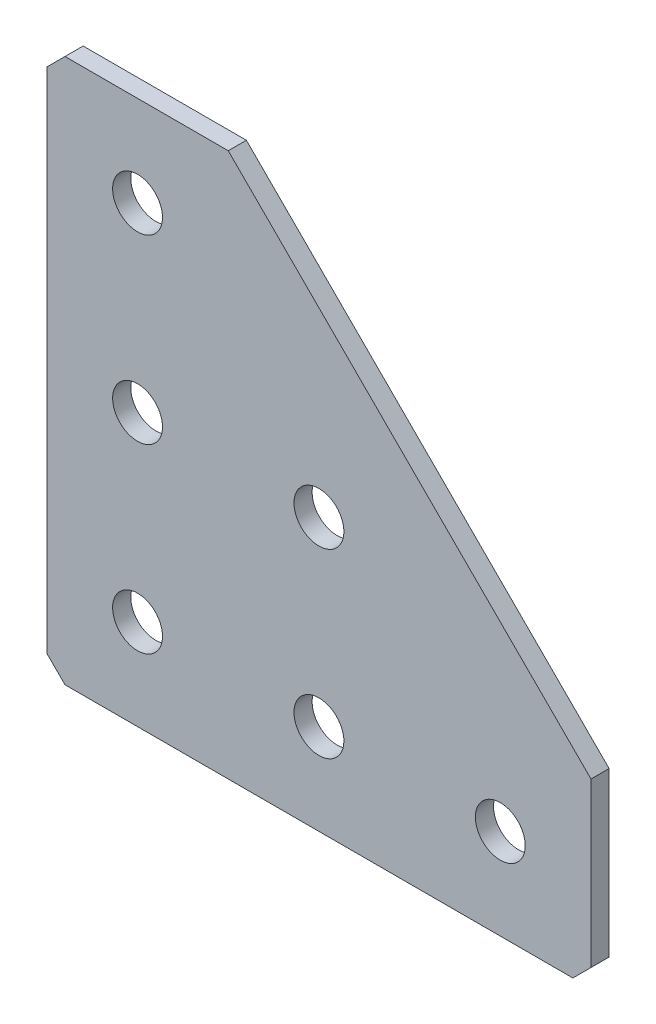
ISO-10303-21;
HEADER;
FILE_DESCRIPTION(('STEP AP214'),'2;1');
FILE_NAME('part.step','',(''),(''),'','','');
FILE_SCHEMA(('AUTOMOTIVE_DESIGN { 1 0 10303 214 1 1 1 1 }'));
ENDSEC;
DATA;
#1=APPLICATION_CONTEXT('core data for automotive mechanical design processes');
#2=APPLICATION_PROTOCOL_DEFINITION('international standard','automotive_design',2000,#1);
#3=PRODUCT_CONTEXT('',#1,'mechanical');
#4=PRODUCT('Part','Part','',(#3));
#5=PRODUCT_RELATED_PRODUCT_CATEGORY('part','',(#4));
#6=PRODUCT_DEFINITION_FORMATION('','',#4);
#7=PRODUCT_DEFINITION_CONTEXT('part definition',#1,'design');
#8=PRODUCT_DEFINITION('design','',#6,#7);
#9=PRODUCT_DEFINITION_SHAPE('','',#8);
#10=(LENGTH_UNIT() NAMED_UNIT(*) SI_UNIT(.MILLI.,.METRE.));
#11=(NAMED_UNIT(*) PLANE_ANGLE_UNIT() SI_UNIT($,.RADIAN.));
#12=(NAMED_UNIT(*) SI_UNIT($,.STERADIAN.) SOLID_ANGLE_UNIT());
#13=UNCERTAINTY_MEASURE_WITH_UNIT(LENGTH_MEASURE(1.E-05),#10,'distance_accuracy_value','');
#14=(GEOMETRIC_REPRESENTATION_CONTEXT(3) GLOBAL_UNCERTAINTY_ASSIGNED_CONTEXT((#13)) GLOBAL_UNIT_ASSIGNED_CONTEXT((#10,
#11,#12)) REPRESENTATION_CONTEXT('',''));
#15=CARTESIAN_POINT('',(0.,0.,0.));
#16=DIRECTION('',(0.,0.,1.));
#17=DIRECTION('',(1.,0.,0.));
#18=AXIS2_PLACEMENT_3D('',#15,#16,#17);
#19=CARTESIAN_POINT('',(0.,0.,0.));
#20=DIRECTION('',(0.,0.,1.));
#21=DIRECTION('',(1.,0.,0.));
#22=AXIS2_PLACEMENT_3D('',#19,#20,#21);
#23=PLANE('',#22);
#24=CARTESIAN_POINT('',(30.,-50.,0.));
#25=DIRECTION('',(0.,0.,-1.));
#26=DIRECTION('',(0.,1.,0.));
#27=AXIS2_PLACEMENT_3D('',#24,#25,#26);
#28=CIRCLE('',#27,2.75);
#29=CARTESIAN_POINT('',(30.,-47.25,0.));
#30=VERTEX_POINT('',#29);
#31=EDGE_CURVE('E251',#30,#30,#28,.T.);
#32=ORIENTED_EDGE('',*,*,#31,.T.);
#33=EDGE_LOOP('',(#32));
#34=FACE_BOUND('',#33,.T.);
#35=CARTESIAN_POINT('',(10.,-50.,0.));
#36=DIRECTION('',(0.,0.,-1.));
#37=DIRECTION('',(0.,1.,0.));
#38=AXIS2_PLACEMENT_3D('',#35,#36,#37);
#39=CIRCLE('',#38,2.75);
#40=CARTESIAN_POINT('',(10.,-47.25,0.));
#41=VERTEX_POINT('',#40);
#42=EDGE_CURVE('E243',#41,#41,#39,.T.);
#43=ORIENTED_EDGE('',*,*,#42,.T.);
#44=EDGE_LOOP('',(#43));
#45=FACE_BOUND('',#44,.T.);
#46=CARTESIAN_POINT('',(10.,-30.,0.));
#47=DIRECTION('',(0.,0.,-1.));
#48=DIRECTION('',(0.,1.,0.));
#49=AXIS2_PLACEMENT_3D('',#46,#47,#48);
#50=CIRCLE('',#49,2.75);
#51=CARTESIAN_POINT('',(10.,-27.25,0.));
#52=VERTEX_POINT('',#51);
#53=EDGE_CURVE('E235',#52,#52,#50,.T.);
#54=ORIENTED_EDGE('',*,*,#53,.T.);
#55=EDGE_LOOP('',(#54));
#56=FACE_BOUND('',#55,.T.);
#57=CARTESIAN_POINT('',(10.,-9.99999999999999,0.));
#58=DIRECTION('',(0.,0.,-1.));
#59=DIRECTION('',(0.,1.,0.));
#60=AXIS2_PLACEMENT_3D('',#57,#58,#59);
#61=CIRCLE('',#60,2.75);
#62=CARTESIAN_POINT('',(10.,-7.25,0.));
#63=VERTEX_POINT('',#62);
#64=EDGE_CURVE('E227',#63,#63,#61,.T.);
#65=ORIENTED_EDGE('',*,*,#64,.T.);
#66=EDGE_LOOP('',(#65));
#67=FACE_BOUND('',#66,.T.);
#68=DIRECTION('',(1.,0.,0.));
#69=VECTOR('',#68,1.);
#70=CARTESIAN_POINT('',(20.,0.,0.));
#71=LINE('',#70,#69);
#72=CARTESIAN_POINT('',(2.00000000000001,0.,0.));
#73=VERTEX_POINT('',#72);
#74=CARTESIAN_POINT('',(20.,0.,0.));
#75=VERTEX_POINT('',#74);
#76=EDGE_CURVE('E137',#73,#75,#71,.T.);
#77=ORIENTED_EDGE('',*,*,#76,.F.);
#78=DIRECTION('',(0.707106781186546,0.707106781186549,0.));
#79=VECTOR('',#78,1.);
#80=CARTESIAN_POINT('',(1.00000000000001,-1.,0.));
#81=LINE('',#80,#79);
#82=CARTESIAN_POINT('',(0.,-2.00000000000002,0.));
#83=VERTEX_POINT('',#82);
#84=EDGE_CURVE('E157',#73,#83,#81,.F.);
#85=ORIENTED_EDGE('',*,*,#84,.T.);
#86=DIRECTION('',(0.,1.,0.));
#87=VECTOR('',#86,1.);
#88=CARTESIAN_POINT('',(0.,0.,0.));
#89=LINE('',#88,#87);
#90=CARTESIAN_POINT('',(0.,-58.,0.));
#91=VERTEX_POINT('',#90);
#92=EDGE_CURVE('E123',#91,#83,#89,.T.);
#93=ORIENTED_EDGE('',*,*,#92,.F.);
#94=DIRECTION('',(-0.707106781186549,0.707106781186546,0.));
#95=VECTOR('',#94,1.);
#96=CARTESIAN_POINT('',(-29.,-29.0000000000001,0.));
#97=LINE('',#96,#95);
#98=CARTESIAN_POINT('',(2.00000000000001,-60.,0.));
#99=VERTEX_POINT('',#98);
#100=EDGE_CURVE('E146',#91,#99,#97,.F.);
#101=ORIENTED_EDGE('',*,*,#100,.T.);
#102=DIRECTION('',(-1.,0.,0.));
#103=VECTOR('',#102,1.);
#104=CARTESIAN_POINT('',(0.,-60.,0.));
#105=LINE('',#104,#103);
#106=CARTESIAN_POINT('',(58.,-60.,0.));
#107=VERTEX_POINT('',#106);
#108=EDGE_CURVE('E182',#107,#99,#105,.T.);
#109=ORIENTED_EDGE('',*,*,#108,.F.);
#110=DIRECTION('',(-0.707106781186546,-0.707106781186549,0.));
#111=VECTOR('',#110,1.);
#112=CARTESIAN_POINT('',(59.0000000000001,-58.9999999999999,0.));
#113=LINE('',#112,#111);
#114=CARTESIAN_POINT('',(60.,-58.,0.));
#115=VERTEX_POINT('',#114);
#116=EDGE_CURVE('E154',#107,#115,#113,.F.);
#117=ORIENTED_EDGE('',*,*,#116,.T.);
#118=DIRECTION('',(0.,-1.,0.));
#119=VECTOR('',#118,1.);
#120=CARTESIAN_POINT('',(60.,-60.,0.));
#121=LINE('',#120,#119);
#122=CARTESIAN_POINT('',(60.,-40.,0.));
#123=VERTEX_POINT('',#122);
#124=EDGE_CURVE('E191',#123,#115,#121,.T.);
#125=ORIENTED_EDGE('',*,*,#124,.F.);
#126=DIRECTION('',(0.707106781186548,-0.707106781186548,0.));
#127=VECTOR('',#126,1.);
#128=CARTESIAN_POINT('',(20.,0.,0.));
#129=LINE('',#128,#127);
#130=EDGE_CURVE('E198',#75,#123,#129,.T.);
#131=ORIENTED_EDGE('',*,*,#130,.F.);
#132=EDGE_LOOP('',(#77,#85,#93,#101,#109,#117,#125,#131));
#133=FACE_BOUND('',#132,.T.);
#134=CARTESIAN_POINT('',(30.,-30.,0.));
#135=DIRECTION('',(0.,0.,-1.));
#136=DIRECTION('',(0.,1.,0.));
#137=AXIS2_PLACEMENT_3D('',#134,#135,#136);
#138=CIRCLE('',#137,2.75);
#139=CARTESIAN_POINT('',(30.,-27.25,0.));
#140=VERTEX_POINT('',#139);
#141=EDGE_CURVE('E205',#140,#140,#138,.T.);
#142=ORIENTED_EDGE('',*,*,#141,.T.);
#143=EDGE_LOOP('',(#142));
#144=FACE_BOUND('',#143,.T.);
#145=CARTESIAN_POINT('',(50.,-50.,0.));
#146=DIRECTION('',(0.,0.,-1.));
#147=DIRECTION('',(0.,1.,0.));
#148=AXIS2_PLACEMENT_3D('',#145,#146,#147);
#149=CIRCLE('',#148,2.75);
#150=CARTESIAN_POINT('',(50.,-47.25,0.));
#151=VERTEX_POINT('',#150);
#152=EDGE_CURVE('E219',#151,#151,#149,.T.);
#153=ORIENTED_EDGE('',*,*,#152,.T.);
#154=EDGE_LOOP('',(#153));
#155=FACE_BOUND('',#154,.T.);
#156=ADVANCED_FACE('F45',(#34,#45,#56,#67,#133,#144,#155),#23,.T.);
#157=CARTESIAN_POINT('',(20.,0.,-2.));
#158=DIRECTION('',(0.,-1.,0.));
#159=DIRECTION('',(1.,0.,0.));
#160=AXIS2_PLACEMENT_3D('',#157,#158,#159);
#161=PLANE('',#160);
#162=DIRECTION('',(1.,0.,0.));
#163=VECTOR('',#162,1.);
#164=CARTESIAN_POINT('',(20.,0.,-2.));
#165=LINE('',#164,#163);
#166=CARTESIAN_POINT('',(2.00000000000001,0.,-2.));
#167=VERTEX_POINT('',#166);
#168=CARTESIAN_POINT('',(20.,0.,-2.));
#169=VERTEX_POINT('',#168);
#170=EDGE_CURVE('E110',#167,#169,#165,.T.);
#171=ORIENTED_EDGE('',*,*,#170,.F.);
#172=DIRECTION('',(0.,0.,1.));
#173=VECTOR('',#172,1.);
#174=CARTESIAN_POINT('',(2.00000000000001,0.,-2.));
#175=LINE('',#174,#173);
#176=EDGE_CURVE('E140',#167,#73,#175,.T.);
#177=ORIENTED_EDGE('',*,*,#176,.T.);
#178=ORIENTED_EDGE('',*,*,#76,.T.);
#179=DIRECTION('',(0.,0.,1.));
#180=VECTOR('',#179,1.);
#181=CARTESIAN_POINT('',(20.,0.,-2.));
#182=LINE('',#181,#180);
#183=EDGE_CURVE('E128',#169,#75,#182,.T.);
#184=ORIENTED_EDGE('',*,*,#183,.F.);
#185=EDGE_LOOP('',(#171,#177,#178,#184));
#186=FACE_BOUND('',#185,.T.);
#187=ADVANCED_FACE('F135',(#186),#161,.F.);
#188=CARTESIAN_POINT('',(20.,0.,-2.));
#189=DIRECTION('',(-0.707106781186547,-0.707106781186547,0.));
#190=DIRECTION('',(0.707106781186548,-0.707106781186548,0.));
#191=AXIS2_PLACEMENT_3D('',#188,#189,#190);
#192=PLANE('',#191);
#193=ORIENTED_EDGE('',*,*,#130,.T.);
#194=DIRECTION('',(0.,0.,1.));
#195=VECTOR('',#194,1.);
#196=CARTESIAN_POINT('',(60.,-40.,-2.));
#197=LINE('',#196,#195);
#198=CARTESIAN_POINT('',(60.,-40.,-2.));
#199=VERTEX_POINT('',#198);
#200=EDGE_CURVE('E130',#199,#123,#197,.T.);
#201=ORIENTED_EDGE('',*,*,#200,.F.);
#202=DIRECTION('',(0.707106781186548,-0.707106781186548,0.));
#203=VECTOR('',#202,1.);
#204=CARTESIAN_POINT('',(20.,0.,-2.));
#205=LINE('',#204,#203);
#206=EDGE_CURVE('E114',#169,#199,#205,.T.);
#207=ORIENTED_EDGE('',*,*,#206,.F.);
#208=ORIENTED_EDGE('',*,*,#183,.T.);
#209=EDGE_LOOP('',(#193,#201,#207,#208));
#210=FACE_BOUND('',#209,.T.);
#211=ADVANCED_FACE('F127',(#210),#192,.F.);
#212=CARTESIAN_POINT('',(60.,-60.,-2.));
#213=DIRECTION('',(-1.,0.,0.));
#214=DIRECTION('',(0.,-1.,0.));
#215=AXIS2_PLACEMENT_3D('',#212,#213,#214);
#216=PLANE('',#215);
#217=ORIENTED_EDGE('',*,*,#124,.T.);
#218=DIRECTION('',(0.,0.,-1.));
#219=VECTOR('',#218,1.);
#220=CARTESIAN_POINT('',(60.,-58.,-2.));
#221=LINE('',#220,#219);
#222=CARTESIAN_POINT('',(60.,-58.,-2.));
#223=VERTEX_POINT('',#222);
#224=EDGE_CURVE('E11',#115,#223,#221,.T.);
#225=ORIENTED_EDGE('',*,*,#224,.T.);
#226=DIRECTION('',(0.,-1.,0.));
#227=VECTOR('',#226,1.);
#228=CARTESIAN_POINT('',(60.,-60.,-2.));
#229=LINE('',#228,#227);
#230=EDGE_CURVE('E133',#199,#223,#229,.T.);
#231=ORIENTED_EDGE('',*,*,#230,.F.);
#232=ORIENTED_EDGE('',*,*,#200,.T.);
#233=EDGE_LOOP('',(#217,#225,#231,#232));
#234=FACE_BOUND('',#233,.T.);
#235=ADVANCED_FACE('F304',(#234),#216,.F.);
#236=CARTESIAN_POINT('',(0.,-60.,-2.));
#237=DIRECTION('',(0.,1.,0.));
#238=DIRECTION('',(0.,0.,1.));
#239=AXIS2_PLACEMENT_3D('',#236,#237,#238);
#240=PLANE('',#239);
#241=DIRECTION('',(-1.,0.,0.));
#242=VECTOR('',#241,1.);
#243=CARTESIAN_POINT('',(0.,-60.,-2.));
#244=LINE('',#243,#242);
#245=CARTESIAN_POINT('',(58.,-60.,-2.));
#246=VERTEX_POINT('',#245);
#247=CARTESIAN_POINT('',(2.00000000000001,-60.,-2.));
#248=VERTEX_POINT('',#247);
#249=EDGE_CURVE('E183',#246,#248,#244,.T.);
#250=ORIENTED_EDGE('',*,*,#249,.F.);
#251=DIRECTION('',(0.,0.,1.));
#252=VECTOR('',#251,1.);
#253=CARTESIAN_POINT('',(58.,-60.,-2.));
#254=LINE('',#253,#252);
#255=EDGE_CURVE('E54',#246,#107,#254,.T.);
#256=ORIENTED_EDGE('',*,*,#255,.T.);
#257=ORIENTED_EDGE('',*,*,#108,.T.);
#258=DIRECTION('',(0.,0.,-1.));
#259=VECTOR('',#258,1.);
#260=CARTESIAN_POINT('',(2.00000000000002,-60.,-2.));
#261=LINE('',#260,#259);
#262=EDGE_CURVE('E61',#99,#248,#261,.T.);
#263=ORIENTED_EDGE('',*,*,#262,.T.);
#264=EDGE_LOOP('',(#250,#256,#257,#263));
#265=FACE_BOUND('',#264,.T.);
#266=ADVANCED_FACE('F181',(#265),#240,.F.);
#267=CARTESIAN_POINT('',(0.,0.,-2.));
#268=DIRECTION('',(1.,0.,0.));
#269=DIRECTION('',(0.,0.,-1.));
#270=AXIS2_PLACEMENT_3D('',#267,#268,#269);
#271=PLANE('',#270);
#272=ORIENTED_EDGE('',*,*,#92,.T.);
#273=DIRECTION('',(0.,0.,-1.));
#274=VECTOR('',#273,1.);
#275=CARTESIAN_POINT('',(0.,-2.00000000000002,-2.));
#276=LINE('',#275,#274);
#277=CARTESIAN_POINT('',(0.,-2.00000000000002,-2.));
#278=VERTEX_POINT('',#277);
#279=EDGE_CURVE('E164',#83,#278,#276,.T.);
#280=ORIENTED_EDGE('',*,*,#279,.T.);
#281=DIRECTION('',(0.,1.,0.));
#282=VECTOR('',#281,1.);
#283=CARTESIAN_POINT('',(0.,0.,-2.));
#284=LINE('',#283,#282);
#285=CARTESIAN_POINT('',(0.,-58.,-2.));
#286=VERTEX_POINT('',#285);
#287=EDGE_CURVE('E148',#286,#278,#284,.T.);
#288=ORIENTED_EDGE('',*,*,#287,.F.);
#289=DIRECTION('',(0.,0.,1.));
#290=VECTOR('',#289,1.);
#291=CARTESIAN_POINT('',(0.,-58.,-2.));
#292=LINE('',#291,#290);
#293=EDGE_CURVE('E160',#286,#91,#292,.T.);
#294=ORIENTED_EDGE('',*,*,#293,.T.);
#295=EDGE_LOOP('',(#272,#280,#288,#294));
#296=FACE_BOUND('',#295,.T.);
#297=ADVANCED_FACE('F267',(#296),#271,.F.);
#298=CARTESIAN_POINT('',(0.,0.,-2.));
#299=DIRECTION('',(0.,0.,1.));
#300=DIRECTION('',(1.,0.,0.));
#301=AXIS2_PLACEMENT_3D('',#298,#299,#300);
#302=PLANE('',#301);
#303=CARTESIAN_POINT('',(30.,-50.,-2.));
#304=DIRECTION('',(0.,0.,-1.));
#305=DIRECTION('',(0.,1.,0.));
#306=AXIS2_PLACEMENT_3D('',#303,#304,#305);
#307=CIRCLE('',#306,2.75);
#308=CARTESIAN_POINT('',(30.,-47.25,-2.));
#309=VERTEX_POINT('',#308);
#310=EDGE_CURVE('E255',#309,#309,#307,.T.);
#311=ORIENTED_EDGE('',*,*,#310,.F.);
#312=EDGE_LOOP('',(#311));
#313=FACE_BOUND('',#312,.T.);
#314=CARTESIAN_POINT('',(10.,-50.,-2.));
#315=DIRECTION('',(0.,0.,-1.));
#316=DIRECTION('',(0.,1.,0.));
#317=AXIS2_PLACEMENT_3D('',#314,#315,#316);
#318=CIRCLE('',#317,2.75);
#319=CARTESIAN_POINT('',(10.,-47.25,-2.));
#320=VERTEX_POINT('',#319);
#321=EDGE_CURVE('E247',#320,#320,#318,.T.);
#322=ORIENTED_EDGE('',*,*,#321,.F.);
#323=EDGE_LOOP('',(#322));
#324=FACE_BOUND('',#323,.T.);
#325=CARTESIAN_POINT('',(10.,-30.,-2.));
#326=DIRECTION('',(0.,0.,-1.));
#327=DIRECTION('',(0.,1.,0.));
#328=AXIS2_PLACEMENT_3D('',#325,#326,#327);
#329=CIRCLE('',#328,2.75);
#330=CARTESIAN_POINT('',(10.,-27.25,-2.));
#331=VERTEX_POINT('',#330);
#332=EDGE_CURVE('E239',#331,#331,#329,.T.);
#333=ORIENTED_EDGE('',*,*,#332,.F.);
#334=EDGE_LOOP('',(#333));
#335=FACE_BOUND('',#334,.T.);
#336=CARTESIAN_POINT('',(10.,-9.99999999999999,-2.));
#337=DIRECTION('',(0.,0.,-1.));
#338=DIRECTION('',(0.,1.,0.));
#339=AXIS2_PLACEMENT_3D('',#336,#337,#338);
#340=CIRCLE('',#339,2.75);
#341=CARTESIAN_POINT('',(10.,-7.24999999999999,-2.));
#342=VERTEX_POINT('',#341);
#343=EDGE_CURVE('E231',#342,#342,#340,.T.);
#344=ORIENTED_EDGE('',*,*,#343,.F.);
#345=EDGE_LOOP('',(#344));
#346=FACE_BOUND('',#345,.T.);
#347=CARTESIAN_POINT('',(50.,-50.,-2.));
#348=DIRECTION('',(0.,0.,-1.));
#349=DIRECTION('',(0.,1.,0.));
#350=AXIS2_PLACEMENT_3D('',#347,#348,#349);
#351=CIRCLE('',#350,2.75);
#352=CARTESIAN_POINT('',(50.,-47.25,-2.));
#353=VERTEX_POINT('',#352);
#354=EDGE_CURVE('E223',#353,#353,#351,.T.);
#355=ORIENTED_EDGE('',*,*,#354,.F.);
#356=EDGE_LOOP('',(#355));
#357=FACE_BOUND('',#356,.T.);
#358=CARTESIAN_POINT('',(30.,-30.,-2.));
#359=DIRECTION('',(0.,0.,-1.));
#360=DIRECTION('',(0.,1.,0.));
#361=AXIS2_PLACEMENT_3D('',#358,#359,#360);
#362=CIRCLE('',#361,2.75);
#363=CARTESIAN_POINT('',(30.,-27.25,-2.));
#364=VERTEX_POINT('',#363);
#365=EDGE_CURVE('E215',#364,#364,#362,.T.);
#366=ORIENTED_EDGE('',*,*,#365,.F.);
#367=EDGE_LOOP('',(#366));
#368=FACE_BOUND('',#367,.T.);
#369=ORIENTED_EDGE('',*,*,#287,.T.);
#370=DIRECTION('',(-0.707106781186546,-0.707106781186549,0.));
#371=VECTOR('',#370,1.);
#372=CARTESIAN_POINT('',(2.00000000000001,0.,-2.));
#373=LINE('',#372,#371);
#374=EDGE_CURVE('E117',#278,#167,#373,.F.);
#375=ORIENTED_EDGE('',*,*,#374,.T.);
#376=ORIENTED_EDGE('',*,*,#170,.T.);
#377=ORIENTED_EDGE('',*,*,#206,.T.);
#378=ORIENTED_EDGE('',*,*,#230,.T.);
#379=DIRECTION('',(0.707106781186546,0.707106781186549,0.));
#380=VECTOR('',#379,1.);
#381=CARTESIAN_POINT('',(58.,-60.,-2.));
#382=LINE('',#381,#380);
#383=EDGE_CURVE('E68',#223,#246,#382,.F.);
#384=ORIENTED_EDGE('',*,*,#383,.T.);
#385=ORIENTED_EDGE('',*,*,#249,.T.);
#386=DIRECTION('',(0.707106781186549,-0.707106781186546,0.));
#387=VECTOR('',#386,1.);
#388=CARTESIAN_POINT('',(0.,-58.,-2.));
#389=LINE('',#388,#387);
#390=EDGE_CURVE('E167',#248,#286,#389,.F.);
#391=ORIENTED_EDGE('',*,*,#390,.T.);
#392=EDGE_LOOP('',(#369,#375,#376,#377,#378,#384,#385,#391));
#393=FACE_BOUND('',#392,.T.);
#394=ADVANCED_FACE('F113',(#313,#324,#335,#346,#357,#368,#393),#302,.F.);
#395=CARTESIAN_POINT('',(30.,-30.,-2.));
#396=DIRECTION('',(0.,0.,-1.));
#397=DIRECTION('',(0.,1.,0.));
#398=AXIS2_PLACEMENT_3D('',#395,#396,#397);
#399=CYLINDRICAL_SURFACE('',#398,2.75);
#400=ORIENTED_EDGE('',*,*,#141,.F.);
#401=EDGE_LOOP('',(#400));
#402=FACE_BOUND('',#401,.T.);
#403=ORIENTED_EDGE('',*,*,#365,.T.);
#404=EDGE_LOOP('',(#403));
#405=FACE_BOUND('',#404,.T.);
#406=ADVANCED_FACE('F266',(#402,#405),#399,.F.);
#407=CARTESIAN_POINT('',(50.,-50.,-2.));
#408=DIRECTION('',(0.,0.,-1.));
#409=DIRECTION('',(0.,1.,0.));
#410=AXIS2_PLACEMENT_3D('',#407,#408,#409);
#411=CYLINDRICAL_SURFACE('',#410,2.75);
#412=ORIENTED_EDGE('',*,*,#152,.F.);
#413=EDGE_LOOP('',(#412));
#414=FACE_BOUND('',#413,.T.);
#415=ORIENTED_EDGE('',*,*,#354,.T.);
#416=EDGE_LOOP('',(#415));
#417=FACE_BOUND('',#416,.T.);
#418=ADVANCED_FACE('F280',(#414,#417),#411,.F.);
#419=CARTESIAN_POINT('',(10.,-9.99999999999999,-2.));
#420=DIRECTION('',(0.,0.,-1.));
#421=DIRECTION('',(0.,1.,0.));
#422=AXIS2_PLACEMENT_3D('',#419,#420,#421);
#423=CYLINDRICAL_SURFACE('',#422,2.75);
#424=ORIENTED_EDGE('',*,*,#64,.F.);
#425=EDGE_LOOP('',(#424));
#426=FACE_BOUND('',#425,.T.);
#427=ORIENTED_EDGE('',*,*,#343,.T.);
#428=EDGE_LOOP('',(#427));
#429=FACE_BOUND('',#428,.T.);
#430=ADVANCED_FACE('F286',(#426,#429),#423,.F.);
#431=CARTESIAN_POINT('',(10.,-30.,-2.));
#432=DIRECTION('',(0.,0.,-1.));
#433=DIRECTION('',(0.,1.,0.));
#434=AXIS2_PLACEMENT_3D('',#431,#432,#433);
#435=CYLINDRICAL_SURFACE('',#434,2.75);
#436=ORIENTED_EDGE('',*,*,#53,.F.);
#437=EDGE_LOOP('',(#436));
#438=FACE_BOUND('',#437,.T.);
#439=ORIENTED_EDGE('',*,*,#332,.T.);
#440=EDGE_LOOP('',(#439));
#441=FACE_BOUND('',#440,.T.);
#442=ADVANCED_FACE('F351',(#438,#441),#435,.F.);
#443=CARTESIAN_POINT('',(10.,-50.,-2.));
#444=DIRECTION('',(0.,0.,-1.));
#445=DIRECTION('',(0.,1.,0.));
#446=AXIS2_PLACEMENT_3D('',#443,#444,#445);
#447=CYLINDRICAL_SURFACE('',#446,2.75);
#448=ORIENTED_EDGE('',*,*,#42,.F.);
#449=EDGE_LOOP('',(#448));
#450=FACE_BOUND('',#449,.T.);
#451=ORIENTED_EDGE('',*,*,#321,.T.);
#452=EDGE_LOOP('',(#451));
#453=FACE_BOUND('',#452,.T.);
#454=ADVANCED_FACE('F342',(#450,#453),#447,.F.);
#455=CARTESIAN_POINT('',(30.,-50.,-2.));
#456=DIRECTION('',(0.,0.,-1.));
#457=DIRECTION('',(0.,1.,0.));
#458=AXIS2_PLACEMENT_3D('',#455,#456,#457);
#459=CYLINDRICAL_SURFACE('',#458,2.75);
#460=ORIENTED_EDGE('',*,*,#31,.F.);
#461=EDGE_LOOP('',(#460));
#462=FACE_BOUND('',#461,.T.);
#463=ORIENTED_EDGE('',*,*,#310,.T.);
#464=EDGE_LOOP('',(#463));
#465=FACE_BOUND('',#464,.T.);
#466=ADVANCED_FACE('F262',(#462,#465),#459,.F.);
#467=CARTESIAN_POINT('',(2.00000000000001,0.,-2.));
#468=DIRECTION('',(0.707106781186549,-0.707106781186546,0.));
#469=DIRECTION('',(0.,0.,1.));
#470=AXIS2_PLACEMENT_3D('',#467,#468,#469);
#471=PLANE('',#470);
#472=ORIENTED_EDGE('',*,*,#374,.F.);
#473=ORIENTED_EDGE('',*,*,#279,.F.);
#474=ORIENTED_EDGE('',*,*,#84,.F.);
#475=ORIENTED_EDGE('',*,*,#176,.F.);
#476=EDGE_LOOP('',(#472,#473,#474,#475));
#477=FACE_BOUND('',#476,.T.);
#478=ADVANCED_FACE('F310',(#477),#471,.F.);
#479=CARTESIAN_POINT('',(58.,-60.,-2.));
#480=DIRECTION('',(-0.707106781186549,0.707106781186546,0.));
#481=DIRECTION('',(0.,0.,1.));
#482=AXIS2_PLACEMENT_3D('',#479,#480,#481);
#483=PLANE('',#482);
#484=ORIENTED_EDGE('',*,*,#383,.F.);
#485=ORIENTED_EDGE('',*,*,#224,.F.);
#486=ORIENTED_EDGE('',*,*,#116,.F.);
#487=ORIENTED_EDGE('',*,*,#255,.F.);
#488=EDGE_LOOP('',(#484,#485,#486,#487));
#489=FACE_BOUND('',#488,.T.);
#490=ADVANCED_FACE('F312',(#489),#483,.F.);
#491=CARTESIAN_POINT('',(0.,-58.,-2.));
#492=DIRECTION('',(0.707106781186546,0.707106781186549,0.));
#493=DIRECTION('',(0.,0.,1.));
#494=AXIS2_PLACEMENT_3D('',#491,#492,#493);
#495=PLANE('',#494);
#496=ORIENTED_EDGE('',*,*,#390,.F.);
#497=ORIENTED_EDGE('',*,*,#262,.F.);
#498=ORIENTED_EDGE('',*,*,#100,.F.);
#499=ORIENTED_EDGE('',*,*,#293,.F.);
#500=EDGE_LOOP('',(#496,#497,#498,#499));
#501=FACE_BOUND('',#500,.T.);
#502=ADVANCED_FACE('F47',(#501),#495,.F.);
#503=CLOSED_SHELL('',(#156,#187,#211,#235,#266,#297,#394,#406,#418,#430,#442,#454,#466,#478,
#490,#502));
#504=MANIFOLD_SOLID_BREP('B2',#503);
#505=ADVANCED_BREP_SHAPE_REPRESENTATION('',(#18,#504),#14);
#506=SHAPE_DEFINITION_REPRESENTATION(#9,#505);
ENDSEC;
END-ISO-10303-21;
